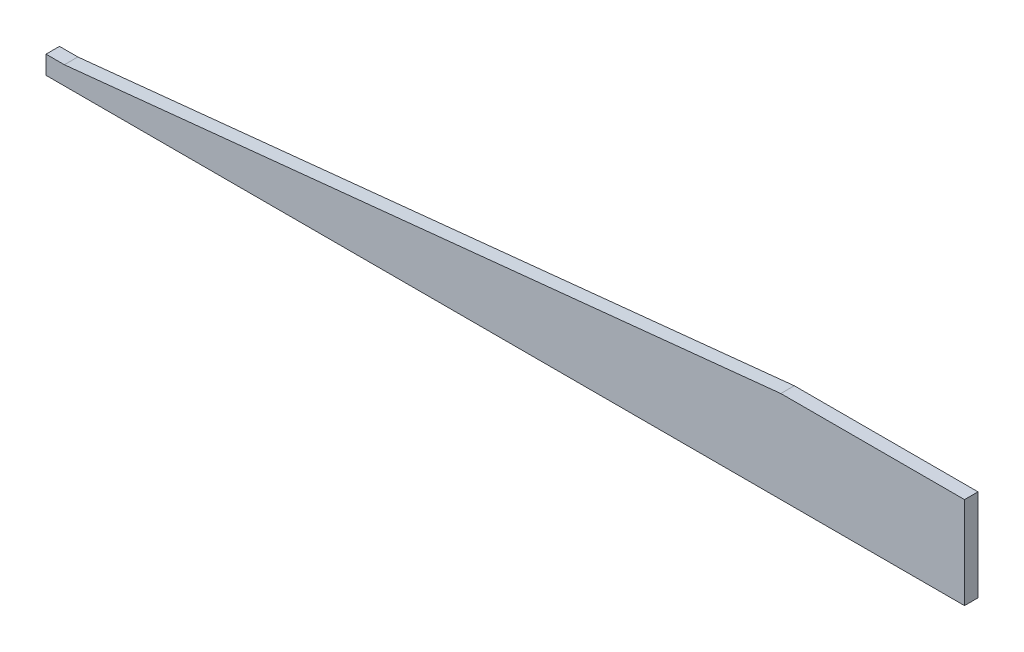
ISO-10303-21;
HEADER;
FILE_DESCRIPTION(('STEP AP214'),'2;1');
FILE_NAME('part.step','',(''),(''),'','','');
FILE_SCHEMA(('AUTOMOTIVE_DESIGN { 1 0 10303 214 1 1 1 1 }'));
ENDSEC;
DATA;
#1=APPLICATION_CONTEXT('core data for automotive mechanical design processes');
#2=APPLICATION_PROTOCOL_DEFINITION('international standard','automotive_design',2000,#1);
#3=PRODUCT_CONTEXT('',#1,'mechanical');
#4=PRODUCT('Part','Part','',(#3));
#5=PRODUCT_RELATED_PRODUCT_CATEGORY('part','',(#4));
#6=PRODUCT_DEFINITION_FORMATION('','',#4);
#7=PRODUCT_DEFINITION_CONTEXT('part definition',#1,'design');
#8=PRODUCT_DEFINITION('design','',#6,#7);
#9=PRODUCT_DEFINITION_SHAPE('','',#8);
#10=(LENGTH_UNIT() NAMED_UNIT(*) SI_UNIT(.MILLI.,.METRE.));
#11=(NAMED_UNIT(*) PLANE_ANGLE_UNIT() SI_UNIT($,.RADIAN.));
#12=(NAMED_UNIT(*) SI_UNIT($,.STERADIAN.) SOLID_ANGLE_UNIT());
#13=UNCERTAINTY_MEASURE_WITH_UNIT(LENGTH_MEASURE(1.E-05),#10,'distance_accuracy_value','');
#14=(GEOMETRIC_REPRESENTATION_CONTEXT(3) GLOBAL_UNCERTAINTY_ASSIGNED_CONTEXT((#13)) GLOBAL_UNIT_ASSIGNED_CONTEXT((#10,
#11,#12)) REPRESENTATION_CONTEXT('',''));
#15=CARTESIAN_POINT('',(0.,0.,0.));
#16=DIRECTION('',(0.,0.,1.));
#17=DIRECTION('',(1.,0.,0.));
#18=AXIS2_PLACEMENT_3D('',#15,#16,#17);
#19=CARTESIAN_POINT('',(30.,30.,22.));
#20=DIRECTION('',(0.,-1.,0.));
#21=DIRECTION('',(1.,0.,0.));
#22=AXIS2_PLACEMENT_3D('',#19,#20,#21);
#23=PLANE('',#22);
#24=DIRECTION('',(-1.,0.,0.));
#25=VECTOR('',#24,1.);
#26=CARTESIAN_POINT('',(30.,30.,0.));
#27=LINE('',#26,#25);
#28=CARTESIAN_POINT('',(30.,30.,0.));
#29=VERTEX_POINT('',#28);
#30=CARTESIAN_POINT('',(0.,30.,0.));
#31=VERTEX_POINT('',#30);
#32=EDGE_CURVE('E117',#29,#31,#27,.T.);
#33=ORIENTED_EDGE('',*,*,#32,.T.);
#34=DIRECTION('',(0.,0.,-1.));
#35=VECTOR('',#34,1.);
#36=CARTESIAN_POINT('',(0.,30.,22.));
#37=LINE('',#36,#35);
#38=CARTESIAN_POINT('',(0.,30.,22.));
#39=VERTEX_POINT('',#38);
#40=EDGE_CURVE('E11',#39,#31,#37,.T.);
#41=ORIENTED_EDGE('',*,*,#40,.F.);
#42=DIRECTION('',(-1.,0.,0.));
#43=VECTOR('',#42,1.);
#44=CARTESIAN_POINT('',(30.,30.,22.));
#45=LINE('',#44,#43);
#46=CARTESIAN_POINT('',(30.,30.,22.));
#47=VERTEX_POINT('',#46);
#48=EDGE_CURVE('E127',#47,#39,#45,.T.);
#49=ORIENTED_EDGE('',*,*,#48,.F.);
#50=DIRECTION('',(0.,0.,-1.));
#51=VECTOR('',#50,1.);
#52=CARTESIAN_POINT('',(30.,30.,22.));
#53=LINE('',#52,#51);
#54=EDGE_CURVE('E113',#47,#29,#53,.T.);
#55=ORIENTED_EDGE('',*,*,#54,.T.);
#56=EDGE_LOOP('',(#33,#41,#49,#55));
#57=FACE_BOUND('',#56,.T.);
#58=ADVANCED_FACE('F33',(#57),#23,.F.);
#59=CARTESIAN_POINT('',(0.,30.,22.));
#60=DIRECTION('',(1.,0.,0.));
#61=DIRECTION('',(0.,1.,0.));
#62=AXIS2_PLACEMENT_3D('',#59,#60,#61);
#63=PLANE('',#62);
#64=DIRECTION('',(0.,-1.,0.));
#65=VECTOR('',#64,1.);
#66=CARTESIAN_POINT('',(0.,30.,0.));
#67=LINE('',#66,#65);
#68=CARTESIAN_POINT('',(0.,0.,0.));
#69=VERTEX_POINT('',#68);
#70=EDGE_CURVE('E120',#31,#69,#67,.T.);
#71=ORIENTED_EDGE('',*,*,#70,.T.);
#72=DIRECTION('',(0.,0.,-1.));
#73=VECTOR('',#72,1.);
#74=CARTESIAN_POINT('',(0.,0.,22.));
#75=LINE('',#74,#73);
#76=CARTESIAN_POINT('',(0.,0.,22.));
#77=VERTEX_POINT('',#76);
#78=EDGE_CURVE('E41',#77,#69,#75,.T.);
#79=ORIENTED_EDGE('',*,*,#78,.F.);
#80=DIRECTION('',(0.,-1.,0.));
#81=VECTOR('',#80,1.);
#82=CARTESIAN_POINT('',(0.,30.,22.));
#83=LINE('',#82,#81);
#84=EDGE_CURVE('E86',#39,#77,#83,.T.);
#85=ORIENTED_EDGE('',*,*,#84,.F.);
#86=ORIENTED_EDGE('',*,*,#40,.T.);
#87=EDGE_LOOP('',(#71,#79,#85,#86));
#88=FACE_BOUND('',#87,.T.);
#89=ADVANCED_FACE('F151',(#88),#63,.F.);
#90=CARTESIAN_POINT('',(0.,0.,22.));
#91=DIRECTION('',(0.,1.,0.));
#92=DIRECTION('',(0.,0.,1.));
#93=AXIS2_PLACEMENT_3D('',#90,#91,#92);
#94=PLANE('',#93);
#95=DIRECTION('',(1.,0.,0.));
#96=VECTOR('',#95,1.);
#97=CARTESIAN_POINT('',(0.,0.,0.));
#98=LINE('',#97,#96);
#99=CARTESIAN_POINT('',(1500.,0.,0.));
#100=VERTEX_POINT('',#99);
#101=EDGE_CURVE('E122',#69,#100,#98,.T.);
#102=ORIENTED_EDGE('',*,*,#101,.T.);
#103=DIRECTION('',(0.,0.,-1.));
#104=VECTOR('',#103,1.);
#105=CARTESIAN_POINT('',(1500.,0.,22.));
#106=LINE('',#105,#104);
#107=CARTESIAN_POINT('',(1500.,0.,22.));
#108=VERTEX_POINT('',#107);
#109=EDGE_CURVE('E108',#108,#100,#106,.T.);
#110=ORIENTED_EDGE('',*,*,#109,.F.);
#111=DIRECTION('',(1.,0.,0.));
#112=VECTOR('',#111,1.);
#113=CARTESIAN_POINT('',(0.,0.,22.));
#114=LINE('',#113,#112);
#115=EDGE_CURVE('E99',#77,#108,#114,.T.);
#116=ORIENTED_EDGE('',*,*,#115,.F.);
#117=ORIENTED_EDGE('',*,*,#78,.T.);
#118=EDGE_LOOP('',(#102,#110,#116,#117));
#119=FACE_BOUND('',#118,.T.);
#120=ADVANCED_FACE('F133',(#119),#94,.F.);
#121=CARTESIAN_POINT('',(1500.,0.,22.));
#122=DIRECTION('',(-1.,0.,0.));
#123=DIRECTION('',(0.,-1.,0.));
#124=AXIS2_PLACEMENT_3D('',#121,#122,#123);
#125=PLANE('',#124);
#126=DIRECTION('',(0.,1.,0.));
#127=VECTOR('',#126,1.);
#128=CARTESIAN_POINT('',(1500.,0.,0.));
#129=LINE('',#128,#127);
#130=CARTESIAN_POINT('',(1500.,150.,0.));
#131=VERTEX_POINT('',#130);
#132=EDGE_CURVE('E107',#100,#131,#129,.T.);
#133=ORIENTED_EDGE('',*,*,#132,.T.);
#134=DIRECTION('',(0.,0.,-1.));
#135=VECTOR('',#134,1.);
#136=CARTESIAN_POINT('',(1500.,150.,22.));
#137=LINE('',#136,#135);
#138=CARTESIAN_POINT('',(1500.,150.,22.));
#139=VERTEX_POINT('',#138);
#140=EDGE_CURVE('E104',#139,#131,#137,.T.);
#141=ORIENTED_EDGE('',*,*,#140,.F.);
#142=DIRECTION('',(0.,1.,0.));
#143=VECTOR('',#142,1.);
#144=CARTESIAN_POINT('',(1500.,0.,22.));
#145=LINE('',#144,#143);
#146=EDGE_CURVE('E93',#108,#139,#145,.T.);
#147=ORIENTED_EDGE('',*,*,#146,.F.);
#148=ORIENTED_EDGE('',*,*,#109,.T.);
#149=EDGE_LOOP('',(#133,#141,#147,#148));
#150=FACE_BOUND('',#149,.T.);
#151=ADVANCED_FACE('F105',(#150),#125,.F.);
#152=CARTESIAN_POINT('',(1200.,150.,22.));
#153=DIRECTION('',(0.,-1.,0.));
#154=DIRECTION('',(0.,0.,-1.));
#155=AXIS2_PLACEMENT_3D('',#152,#153,#154);
#156=PLANE('',#155);
#157=DIRECTION('',(-1.,0.,0.));
#158=VECTOR('',#157,1.);
#159=CARTESIAN_POINT('',(1200.,150.,0.));
#160=LINE('',#159,#158);
#161=CARTESIAN_POINT('',(1200.,150.,0.));
#162=VERTEX_POINT('',#161);
#163=EDGE_CURVE('E72',#131,#162,#160,.T.);
#164=ORIENTED_EDGE('',*,*,#163,.T.);
#165=DIRECTION('',(0.,0.,-1.));
#166=VECTOR('',#165,1.);
#167=CARTESIAN_POINT('',(1200.,150.,22.));
#168=LINE('',#167,#166);
#169=CARTESIAN_POINT('',(1200.,150.,22.));
#170=VERTEX_POINT('',#169);
#171=EDGE_CURVE('E109',#170,#162,#168,.T.);
#172=ORIENTED_EDGE('',*,*,#171,.F.);
#173=DIRECTION('',(-1.,0.,0.));
#174=VECTOR('',#173,1.);
#175=CARTESIAN_POINT('',(1200.,150.,22.));
#176=LINE('',#175,#174);
#177=EDGE_CURVE('E97',#139,#170,#176,.T.);
#178=ORIENTED_EDGE('',*,*,#177,.F.);
#179=ORIENTED_EDGE('',*,*,#140,.T.);
#180=EDGE_LOOP('',(#164,#172,#178,#179));
#181=FACE_BOUND('',#180,.T.);
#182=ADVANCED_FACE('F111',(#181),#156,.F.);
#183=CARTESIAN_POINT('',(30.,30.,22.));
#184=DIRECTION('',(0.102028865498569,-0.994781438611052,0.));
#185=DIRECTION('',(0.994781438611052,0.102028865498569,0.));
#186=AXIS2_PLACEMENT_3D('',#183,#184,#185);
#187=PLANE('',#186);
#188=DIRECTION('',(-0.994781438611052,-0.102028865498569,0.));
#189=VECTOR('',#188,1.);
#190=CARTESIAN_POINT('',(30.,30.,0.));
#191=LINE('',#190,#189);
#192=EDGE_CURVE('E78',#162,#29,#191,.T.);
#193=ORIENTED_EDGE('',*,*,#192,.T.);
#194=ORIENTED_EDGE('',*,*,#54,.F.);
#195=DIRECTION('',(-0.994781438611052,-0.102028865498569,0.));
#196=VECTOR('',#195,1.);
#197=CARTESIAN_POINT('',(30.,30.,22.));
#198=LINE('',#197,#196);
#199=EDGE_CURVE('E49',#170,#47,#198,.T.);
#200=ORIENTED_EDGE('',*,*,#199,.F.);
#201=ORIENTED_EDGE('',*,*,#171,.T.);
#202=EDGE_LOOP('',(#193,#194,#200,#201));
#203=FACE_BOUND('',#202,.T.);
#204=ADVANCED_FACE('F140',(#203),#187,.F.);
#205=CARTESIAN_POINT('',(0.,0.,22.));
#206=DIRECTION('',(0.,0.,1.));
#207=DIRECTION('',(1.,0.,0.));
#208=AXIS2_PLACEMENT_3D('',#205,#206,#207);
#209=PLANE('',#208);
#210=ORIENTED_EDGE('',*,*,#48,.T.);
#211=ORIENTED_EDGE('',*,*,#84,.T.);
#212=ORIENTED_EDGE('',*,*,#115,.T.);
#213=ORIENTED_EDGE('',*,*,#146,.T.);
#214=ORIENTED_EDGE('',*,*,#177,.T.);
#215=ORIENTED_EDGE('',*,*,#199,.T.);
#216=EDGE_LOOP('',(#210,#211,#212,#213,#214,#215));
#217=FACE_BOUND('',#216,.T.);
#218=ADVANCED_FACE('F95',(#217),#209,.T.);
#219=CARTESIAN_POINT('',(0.,0.,0.));
#220=DIRECTION('',(0.,0.,1.));
#221=DIRECTION('',(1.,0.,0.));
#222=AXIS2_PLACEMENT_3D('',#219,#220,#221);
#223=PLANE('',#222);
#224=ORIENTED_EDGE('',*,*,#32,.F.);
#225=ORIENTED_EDGE('',*,*,#192,.F.);
#226=ORIENTED_EDGE('',*,*,#163,.F.);
#227=ORIENTED_EDGE('',*,*,#132,.F.);
#228=ORIENTED_EDGE('',*,*,#101,.F.);
#229=ORIENTED_EDGE('',*,*,#70,.F.);
#230=EDGE_LOOP('',(#224,#225,#226,#227,#228,#229));
#231=FACE_BOUND('',#230,.T.);
#232=ADVANCED_FACE('F136',(#231),#223,.F.);
#233=CLOSED_SHELL('',(#58,#89,#120,#151,#182,#204,#218,#232));
#234=MANIFOLD_SOLID_BREP('B2',#233);
#235=ADVANCED_BREP_SHAPE_REPRESENTATION('',(#18,#234),#14);
#236=SHAPE_DEFINITION_REPRESENTATION(#9,#235);
ENDSEC;
END-ISO-10303-21;
